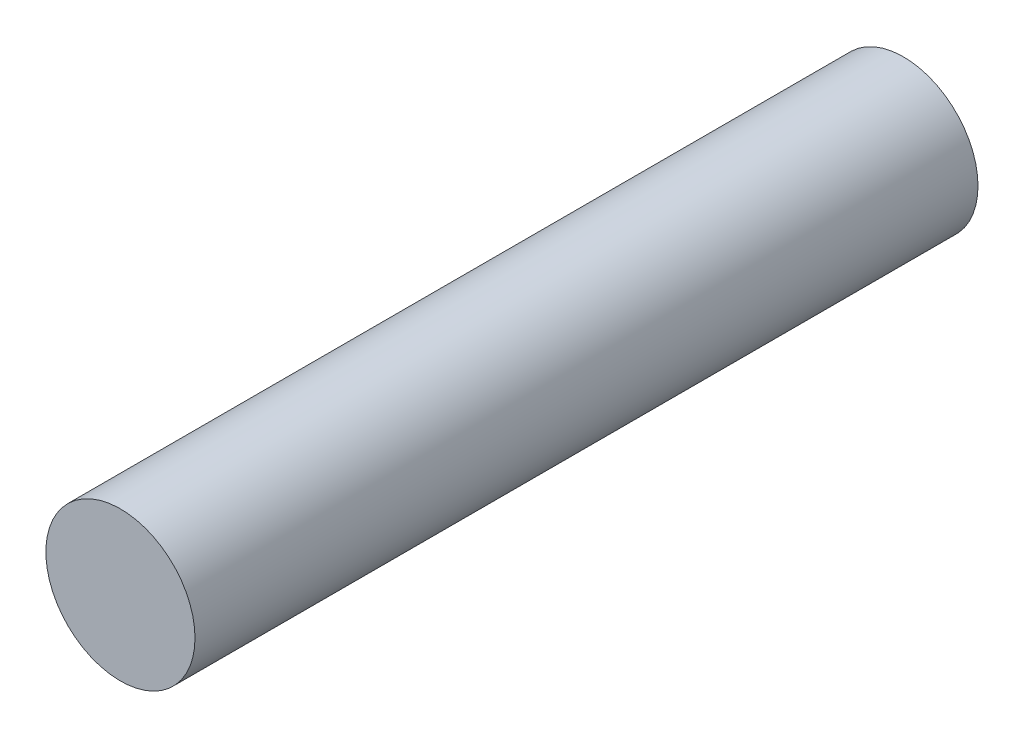
ISO-10303-21;
HEADER;
FILE_DESCRIPTION(('STEP AP214'),'2;1');
FILE_NAME('part.step','',(''),(''),'','','');
FILE_SCHEMA(('AUTOMOTIVE_DESIGN { 1 0 10303 214 1 1 1 1 }'));
ENDSEC;
DATA;
#1=APPLICATION_CONTEXT('core data for automotive mechanical design processes');
#2=APPLICATION_PROTOCOL_DEFINITION('international standard','automotive_design',2000,#1);
#3=PRODUCT_CONTEXT('',#1,'mechanical');
#4=PRODUCT('Part','Part','',(#3));
#5=PRODUCT_RELATED_PRODUCT_CATEGORY('part','',(#4));
#6=PRODUCT_DEFINITION_FORMATION('','',#4);
#7=PRODUCT_DEFINITION_CONTEXT('part definition',#1,'design');
#8=PRODUCT_DEFINITION('design','',#6,#7);
#9=PRODUCT_DEFINITION_SHAPE('','',#8);
#10=(LENGTH_UNIT() NAMED_UNIT(*) SI_UNIT(.MILLI.,.METRE.));
#11=(NAMED_UNIT(*) PLANE_ANGLE_UNIT() SI_UNIT($,.RADIAN.));
#12=(NAMED_UNIT(*) SI_UNIT($,.STERADIAN.) SOLID_ANGLE_UNIT());
#13=UNCERTAINTY_MEASURE_WITH_UNIT(LENGTH_MEASURE(1.E-05),#10,'distance_accuracy_value','');
#14=(GEOMETRIC_REPRESENTATION_CONTEXT(3) GLOBAL_UNCERTAINTY_ASSIGNED_CONTEXT((#13)) GLOBAL_UNIT_ASSIGNED_CONTEXT((#10,
#11,#12)) REPRESENTATION_CONTEXT('',''));
#15=CARTESIAN_POINT('',(0.,0.,0.));
#16=DIRECTION('',(0.,0.,1.));
#17=DIRECTION('',(1.,0.,0.));
#18=AXIS2_PLACEMENT_3D('',#15,#16,#17);
#19=CARTESIAN_POINT('',(0.,0.,21.));
#20=DIRECTION('',(0.,0.,-1.));
#21=DIRECTION('',(-1.,0.,0.));
#22=AXIS2_PLACEMENT_3D('',#19,#20,#21);
#23=CYLINDRICAL_SURFACE('',#22,2.);
#24=CARTESIAN_POINT('',(0.,0.,21.));
#25=DIRECTION('',(0.,0.,1.));
#26=DIRECTION('',(1.,0.,0.));
#27=AXIS2_PLACEMENT_3D('',#24,#25,#26);
#28=CIRCLE('',#27,2.);
#29=CARTESIAN_POINT('',(2.,0.,21.));
#30=VERTEX_POINT('',#29);
#31=EDGE_CURVE('E10',#30,#30,#28,.T.);
#32=ORIENTED_EDGE('',*,*,#31,.F.);
#33=EDGE_LOOP('',(#32));
#34=FACE_BOUND('',#33,.T.);
#35=CARTESIAN_POINT('',(0.,0.,0.));
#36=DIRECTION('',(0.,0.,1.));
#37=DIRECTION('',(1.,0.,0.));
#38=AXIS2_PLACEMENT_3D('',#35,#36,#37);
#39=CIRCLE('',#38,2.);
#40=CARTESIAN_POINT('',(2.,0.,0.));
#41=VERTEX_POINT('',#40);
#42=EDGE_CURVE('E34',#41,#41,#39,.T.);
#43=ORIENTED_EDGE('',*,*,#42,.T.);
#44=EDGE_LOOP('',(#43));
#45=FACE_BOUND('',#44,.T.);
#46=ADVANCED_FACE('F31',(#34,#45),#23,.T.);
#47=CARTESIAN_POINT('',(0.,0.,21.));
#48=DIRECTION('',(0.,0.,1.));
#49=DIRECTION('',(1.,0.,0.));
#50=AXIS2_PLACEMENT_3D('',#47,#48,#49);
#51=PLANE('',#50);
#52=ORIENTED_EDGE('',*,*,#31,.T.);
#53=EDGE_LOOP('',(#52));
#54=FACE_BOUND('',#53,.T.);
#55=ADVANCED_FACE('F46',(#54),#51,.T.);
#56=CARTESIAN_POINT('',(0.,0.,0.));
#57=DIRECTION('',(0.,0.,1.));
#58=DIRECTION('',(1.,0.,0.));
#59=AXIS2_PLACEMENT_3D('',#56,#57,#58);
#60=PLANE('',#59);
#61=ORIENTED_EDGE('',*,*,#42,.F.);
#62=EDGE_LOOP('',(#61));
#63=FACE_BOUND('',#62,.T.);
#64=ADVANCED_FACE('F44',(#63),#60,.F.);
#65=CLOSED_SHELL('',(#46,#55,#64));
#66=MANIFOLD_SOLID_BREP('B2',#65);
#67=ADVANCED_BREP_SHAPE_REPRESENTATION('',(#18,#66),#14);
#68=SHAPE_DEFINITION_REPRESENTATION(#9,#67);
ENDSEC;
END-ISO-10303-21;
